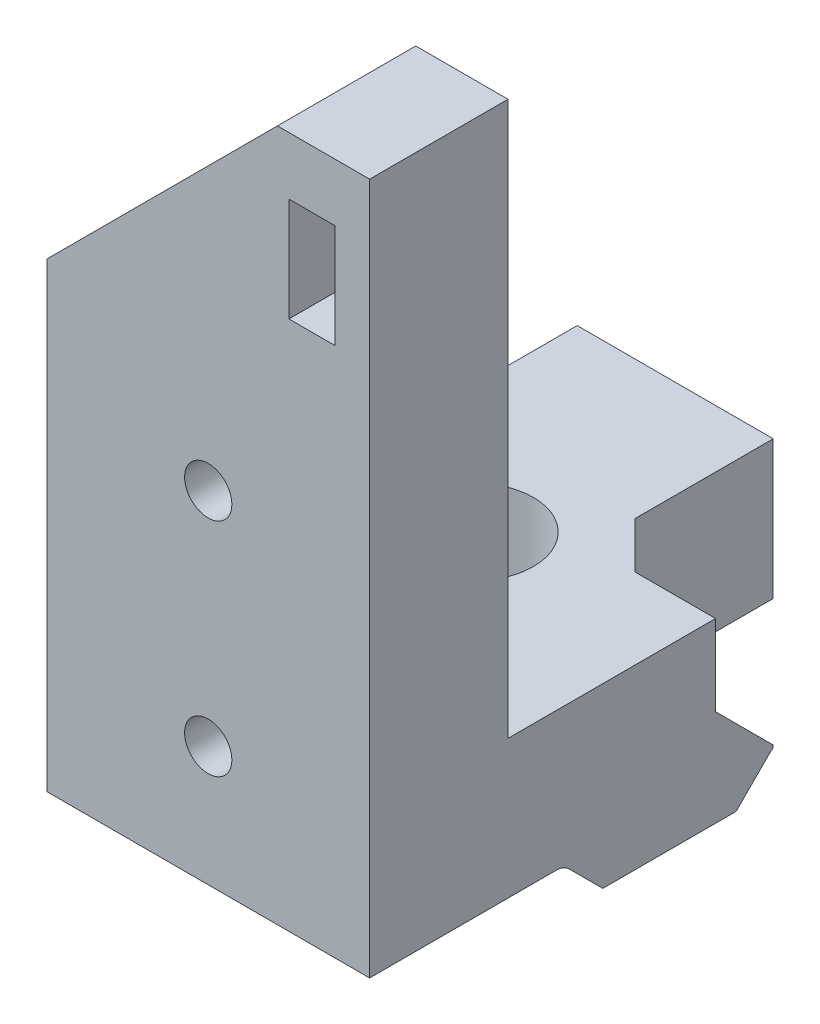
ISO-10303-21;
HEADER;
FILE_DESCRIPTION(('STEP AP214'),'2;1');
FILE_NAME('part.step','',(''),(''),'','','');
FILE_SCHEMA(('AUTOMOTIVE_DESIGN { 1 0 10303 214 1 1 1 1 }'));
ENDSEC;
DATA;
#1=APPLICATION_CONTEXT('core data for automotive mechanical design processes');
#2=APPLICATION_PROTOCOL_DEFINITION('international standard','automotive_design',2000,#1);
#3=PRODUCT_CONTEXT('',#1,'mechanical');
#4=PRODUCT('Part','Part','',(#3));
#5=PRODUCT_RELATED_PRODUCT_CATEGORY('part','',(#4));
#6=PRODUCT_DEFINITION_FORMATION('','',#4);
#7=PRODUCT_DEFINITION_CONTEXT('part definition',#1,'design');
#8=PRODUCT_DEFINITION('design','',#6,#7);
#9=PRODUCT_DEFINITION_SHAPE('','',#8);
#10=(LENGTH_UNIT() NAMED_UNIT(*) SI_UNIT(.MILLI.,.METRE.));
#11=(NAMED_UNIT(*) PLANE_ANGLE_UNIT() SI_UNIT($,.RADIAN.));
#12=(NAMED_UNIT(*) SI_UNIT($,.STERADIAN.) SOLID_ANGLE_UNIT());
#13=UNCERTAINTY_MEASURE_WITH_UNIT(LENGTH_MEASURE(1.E-05),#10,'distance_accuracy_value','');
#14=(GEOMETRIC_REPRESENTATION_CONTEXT(3) GLOBAL_UNCERTAINTY_ASSIGNED_CONTEXT((#13)) GLOBAL_UNIT_ASSIGNED_CONTEXT((#10,
#11,#12)) REPRESENTATION_CONTEXT('',''));
#15=CARTESIAN_POINT('',(0.,0.,0.));
#16=DIRECTION('',(0.,0.,1.));
#17=DIRECTION('',(1.,0.,0.));
#18=AXIS2_PLACEMENT_3D('',#15,#16,#17);
#19=CARTESIAN_POINT('',(46.3642843340703,35.7650594637958,0.));
#20=DIRECTION('',(0.,1.,0.));
#21=DIRECTION('',(0.,0.,1.));
#22=AXIS2_PLACEMENT_3D('',#19,#20,#21);
#23=PLANE('',#22);
#24=DIRECTION('',(-1.,0.,0.));
#25=VECTOR('',#24,1.);
#26=CARTESIAN_POINT('',(46.3642843340703,35.7650594637958,12.7830951969996));
#27=LINE('',#26,#25);
#28=CARTESIAN_POINT('',(46.3642843340703,35.7650594637958,12.7830951969996));
#29=VERTEX_POINT('',#28);
#30=CARTESIAN_POINT('',(32.3642843340703,35.7650594637958,12.7830951969996));
#31=VERTEX_POINT('',#30);
#32=EDGE_CURVE('E343',#29,#31,#27,.T.);
#33=ORIENTED_EDGE('',*,*,#32,.F.);
#34=DIRECTION('',(0.,0.,-1.));
#35=VECTOR('',#34,1.);
#36=CARTESIAN_POINT('',(46.3642843340703,35.7650594637958,0.));
#37=LINE('',#36,#35);
#38=CARTESIAN_POINT('',(46.3642843340703,35.7650594637958,20.8758664827248));
#39=VERTEX_POINT('',#38);
#40=EDGE_CURVE('E290',#39,#29,#37,.T.);
#41=ORIENTED_EDGE('',*,*,#40,.F.);
#42=DIRECTION('',(1.,0.,0.));
#43=VECTOR('',#42,1.);
#44=CARTESIAN_POINT('',(32.3642843340703,35.7650594637958,20.8758664827248));
#45=LINE('',#44,#43);
#46=CARTESIAN_POINT('',(32.3642843340703,35.7650594637958,20.8758664827248));
#47=VERTEX_POINT('',#46);
#48=EDGE_CURVE('E270',#47,#39,#45,.T.);
#49=ORIENTED_EDGE('',*,*,#48,.F.);
#50=DIRECTION('',(0.,0.,-1.));
#51=VECTOR('',#50,1.);
#52=CARTESIAN_POINT('',(32.3642843340703,35.7650594637958,0.));
#53=LINE('',#52,#51);
#54=EDGE_CURVE('E287',#47,#31,#53,.T.);
#55=ORIENTED_EDGE('',*,*,#54,.T.);
#56=EDGE_LOOP('',(#33,#41,#49,#55));
#57=FACE_BOUND('',#56,.T.);
#58=ADVANCED_FACE('F34',(#57),#23,.F.);
#59=CARTESIAN_POINT('',(46.3642843340703,34.9750594637958,12.7830951969996));
#60=DIRECTION('',(-1.,0.,0.));
#61=DIRECTION('',(0.,0.,1.));
#62=AXIS2_PLACEMENT_3D('',#59,#60,#61);
#63=CYLINDRICAL_SURFACE('',#62,0.789999999999999);
#64=CARTESIAN_POINT('',(32.3642843340703,34.9750594637958,12.7830951969996));
#65=DIRECTION('',(1.,0.,0.));
#66=DIRECTION('',(0.,0.,-1.));
#67=AXIS2_PLACEMENT_3D('',#64,#65,#66);
#68=CIRCLE('',#67,0.789999999999999);
#69=CARTESIAN_POINT('',(32.3642843340703,35.5336738209331,12.2244808398622));
#70=VERTEX_POINT('',#69);
#71=EDGE_CURVE('E309',#70,#31,#68,.T.);
#72=ORIENTED_EDGE('',*,*,#71,.F.);
#73=DIRECTION('',(-1.,0.,0.));
#74=VECTOR('',#73,1.);
#75=CARTESIAN_POINT('',(46.3642843340703,35.5336738209331,12.2244808398622));
#76=LINE('',#75,#74);
#77=CARTESIAN_POINT('',(46.3642843340703,35.5336738209331,12.2244808398622));
#78=VERTEX_POINT('',#77);
#79=EDGE_CURVE('E341',#78,#70,#76,.T.);
#80=ORIENTED_EDGE('',*,*,#79,.F.);
#81=CARTESIAN_POINT('',(46.3642843340703,34.9750594637958,12.7830951969996));
#82=DIRECTION('',(1.,0.,0.));
#83=DIRECTION('',(0.,0.,-1.));
#84=AXIS2_PLACEMENT_3D('',#81,#82,#83);
#85=CIRCLE('',#84,0.789999999999999);
#86=EDGE_CURVE('E292',#78,#29,#85,.T.);
#87=ORIENTED_EDGE('',*,*,#86,.T.);
#88=ORIENTED_EDGE('',*,*,#32,.T.);
#89=EDGE_LOOP('',(#72,#80,#87,#88));
#90=FACE_BOUND('',#89,.T.);
#91=ADVANCED_FACE('F446',(#90),#63,.F.);
#92=CARTESIAN_POINT('',(46.3642843340703,11.6545964905354,-11.6545964905355));
#93=DIRECTION('',(0.,-0.707106781186547,0.707106781186548));
#94=DIRECTION('',(0.,-0.707106781186548,-0.707106781186547));
#95=AXIS2_PLACEMENT_3D('',#92,#93,#94);
#96=PLANE('',#95);
#97=DIRECTION('',(0.,0.707106781186548,0.707106781186547));
#98=VECTOR('',#97,1.);
#99=CARTESIAN_POINT('',(32.3642843340703,11.6545964905354,-11.6545964905355));
#100=LINE('',#99,#98);
#101=CARTESIAN_POINT('',(32.3642843340703,34.0750594637958,10.7658664827248));
#102=VERTEX_POINT('',#101);
#103=EDGE_CURVE('E313',#102,#70,#100,.T.);
#104=ORIENTED_EDGE('',*,*,#103,.F.);
#105=DIRECTION('',(-1.,0.,0.));
#106=VECTOR('',#105,1.);
#107=CARTESIAN_POINT('',(46.3642843340703,34.0750594637958,10.7658664827248));
#108=LINE('',#107,#106);
#109=CARTESIAN_POINT('',(46.3642843340703,34.0750594637958,10.7658664827248));
#110=VERTEX_POINT('',#109);
#111=EDGE_CURVE('E339',#110,#102,#108,.T.);
#112=ORIENTED_EDGE('',*,*,#111,.F.);
#113=DIRECTION('',(0.,0.707106781186548,0.707106781186547));
#114=VECTOR('',#113,1.);
#115=CARTESIAN_POINT('',(46.3642843340703,11.6545964905354,-11.6545964905355));
#116=LINE('',#115,#114);
#117=EDGE_CURVE('E296',#110,#78,#116,.T.);
#118=ORIENTED_EDGE('',*,*,#117,.T.);
#119=ORIENTED_EDGE('',*,*,#79,.T.);
#120=EDGE_LOOP('',(#104,#112,#118,#119));
#121=FACE_BOUND('',#120,.T.);
#122=ADVANCED_FACE('F453',(#121),#96,.T.);
#123=CARTESIAN_POINT('',(46.3642843340703,34.0750594637958,0.));
#124=DIRECTION('',(0.,1.,0.));
#125=DIRECTION('',(0.,0.,1.));
#126=AXIS2_PLACEMENT_3D('',#123,#124,#125);
#127=PLANE('',#126);
#128=CARTESIAN_POINT('',(37.8642843340703,34.0750594637958,7.87586648272481));
#129=DIRECTION('',(0.,-1.,0.));
#130=DIRECTION('',(0.,0.,-1.));
#131=AXIS2_PLACEMENT_3D('',#128,#129,#130);
#132=CIRCLE('',#131,2.6);
#133=CARTESIAN_POINT('',(37.8642843340703,34.0750594637958,5.27586648272481));
#134=VERTEX_POINT('',#133);
#135=EDGE_CURVE('E284',#134,#134,#132,.T.);
#136=ORIENTED_EDGE('',*,*,#135,.F.);
#137=EDGE_LOOP('',(#136));
#138=FACE_BOUND('',#137,.T.);
#139=DIRECTION('',(0.,0.,-1.));
#140=VECTOR('',#139,1.);
#141=CARTESIAN_POINT('',(32.3642843340703,34.0750594637958,0.));
#142=LINE('',#141,#140);
#143=CARTESIAN_POINT('',(32.3642843340703,34.0750594637958,4.98586648272482));
#144=VERTEX_POINT('',#143);
#145=EDGE_CURVE('E316',#102,#144,#142,.T.);
#146=ORIENTED_EDGE('',*,*,#145,.T.);
#147=DIRECTION('',(-1.,0.,0.));
#148=VECTOR('',#147,1.);
#149=CARTESIAN_POINT('',(46.3642843340703,34.0750594637958,4.98586648272482));
#150=LINE('',#149,#148);
#151=CARTESIAN_POINT('',(46.3642843340703,34.0750594637958,4.98586648272482));
#152=VERTEX_POINT('',#151);
#153=EDGE_CURVE('E337',#152,#144,#150,.T.);
#154=ORIENTED_EDGE('',*,*,#153,.F.);
#155=DIRECTION('',(0.,0.,-1.));
#156=VECTOR('',#155,1.);
#157=CARTESIAN_POINT('',(46.3642843340703,34.0750594637958,0.));
#158=LINE('',#157,#156);
#159=EDGE_CURVE('E299',#110,#152,#158,.T.);
#160=ORIENTED_EDGE('',*,*,#159,.F.);
#161=ORIENTED_EDGE('',*,*,#111,.T.);
#162=EDGE_LOOP('',(#146,#154,#160,#161));
#163=FACE_BOUND('',#162,.T.);
#164=ADVANCED_FACE('F497',(#138,#163),#127,.F.);
#165=CARTESIAN_POINT('',(46.3642843340703,19.5304629732602,19.5304629732603));
#166=DIRECTION('',(0.,-0.707106781186547,-0.707106781186549));
#167=DIRECTION('',(0.,0.707106781186549,-0.707106781186546));
#168=AXIS2_PLACEMENT_3D('',#165,#166,#167);
#169=PLANE('',#168);
#170=DIRECTION('',(0.,-0.707106781186549,0.707106781186546));
#171=VECTOR('',#170,1.);
#172=CARTESIAN_POINT('',(32.3642843340703,19.5304629732602,19.5304629732603));
#173=LINE('',#172,#171);
#174=CARTESIAN_POINT('',(32.3642843340703,35.5336738209331,3.52725212558745));
#175=VERTEX_POINT('',#174);
#176=EDGE_CURVE('E319',#175,#144,#173,.T.);
#177=ORIENTED_EDGE('',*,*,#176,.F.);
#178=DIRECTION('',(-1.,0.,0.));
#179=VECTOR('',#178,1.);
#180=CARTESIAN_POINT('',(46.3642843340703,35.5336738209331,3.52725212558745));
#181=LINE('',#180,#179);
#182=CARTESIAN_POINT('',(46.3642843340703,35.5336738209331,3.52725212558745));
#183=VERTEX_POINT('',#182);
#184=EDGE_CURVE('E335',#183,#175,#181,.T.);
#185=ORIENTED_EDGE('',*,*,#184,.F.);
#186=DIRECTION('',(0.,-0.707106781186549,0.707106781186546));
#187=VECTOR('',#186,1.);
#188=CARTESIAN_POINT('',(46.3642843340703,19.5304629732602,19.5304629732603));
#189=LINE('',#188,#187);
#190=EDGE_CURVE('E301',#183,#152,#189,.T.);
#191=ORIENTED_EDGE('',*,*,#190,.T.);
#192=ORIENTED_EDGE('',*,*,#153,.T.);
#193=EDGE_LOOP('',(#177,#185,#191,#192));
#194=FACE_BOUND('',#193,.T.);
#195=ADVANCED_FACE('F468',(#194),#169,.T.);
#196=CARTESIAN_POINT('',(46.3642843340703,34.9750594637958,2.96863776845007));
#197=DIRECTION('',(-1.,0.,0.));
#198=DIRECTION('',(0.,0.,1.));
#199=AXIS2_PLACEMENT_3D('',#196,#197,#198);
#200=CYLINDRICAL_SURFACE('',#199,0.790000000000005);
#201=DIRECTION('',(-1.,0.,0.));
#202=VECTOR('',#201,1.);
#203=CARTESIAN_POINT('',(46.3642843340703,35.6520120280646,3.37586648272482));
#204=LINE('',#203,#202);
#205=CARTESIAN_POINT('',(46.3642843340703,35.6520120280646,3.37586648272482));
#206=VERTEX_POINT('',#205);
#207=CARTESIAN_POINT('',(40.8642843340703,35.6520120280646,3.37586648272482));
#208=VERTEX_POINT('',#207);
#209=EDGE_CURVE('E237',#206,#208,#204,.T.);
#210=ORIENTED_EDGE('',*,*,#209,.F.);
#211=CARTESIAN_POINT('',(46.3642843340703,34.9750594637958,2.96863776845007));
#212=DIRECTION('',(1.,0.,0.));
#213=DIRECTION('',(0.,0.,-1.));
#214=AXIS2_PLACEMENT_3D('',#211,#212,#213);
#215=CIRCLE('',#214,0.790000000000005);
#216=EDGE_CURVE('E304',#206,#183,#215,.T.);
#217=ORIENTED_EDGE('',*,*,#216,.T.);
#218=ORIENTED_EDGE('',*,*,#184,.T.);
#219=CARTESIAN_POINT('',(32.3642843340703,34.9750594637958,2.96863776845007));
#220=DIRECTION('',(1.,0.,0.));
#221=DIRECTION('',(0.,0.,-1.));
#222=AXIS2_PLACEMENT_3D('',#219,#220,#221);
#223=CIRCLE('',#222,0.790000000000005);
#224=CARTESIAN_POINT('',(32.3642843340703,35.7650594637958,2.96863776845007));
#225=VERTEX_POINT('',#224);
#226=EDGE_CURVE('E322',#225,#175,#223,.T.);
#227=ORIENTED_EDGE('',*,*,#226,.F.);
#228=DIRECTION('',(-1.,0.,0.));
#229=VECTOR('',#228,1.);
#230=CARTESIAN_POINT('',(46.3642843340703,35.7650594637958,2.96863776845007));
#231=LINE('',#230,#229);
#232=CARTESIAN_POINT('',(40.8642843340703,35.7650594637958,2.96863776845007));
#233=VERTEX_POINT('',#232);
#234=EDGE_CURVE('E333',#233,#225,#231,.T.);
#235=ORIENTED_EDGE('',*,*,#234,.F.);
#236=CARTESIAN_POINT('',(40.8642843340703,34.9750594637958,2.96863776845007));
#237=DIRECTION('',(-1.,0.,0.));
#238=DIRECTION('',(0.,0.,1.));
#239=AXIS2_PLACEMENT_3D('',#236,#237,#238);
#240=CIRCLE('',#239,0.790000000000005);
#241=EDGE_CURVE('E241',#208,#233,#240,.T.);
#242=ORIENTED_EDGE('',*,*,#241,.F.);
#243=EDGE_LOOP('',(#210,#217,#218,#227,#235,#242));
#244=FACE_BOUND('',#243,.T.);
#245=ADVANCED_FACE('F461',(#244),#200,.F.);
#246=DIRECTION('',(-1.,0.,0.));
#247=VECTOR('',#246,1.);
#248=CARTESIAN_POINT('',(46.3642843340703,35.7650594637958,-2.12413351727518));
#249=LINE('',#248,#247);
#250=CARTESIAN_POINT('',(40.8642843340703,35.7650594637958,-2.12413351727518));
#251=VERTEX_POINT('',#250);
#252=CARTESIAN_POINT('',(32.3642843340703,35.7650594637958,-2.12413351727518));
#253=VERTEX_POINT('',#252);
#254=EDGE_CURVE('E331',#251,#253,#249,.T.);
#255=ORIENTED_EDGE('',*,*,#254,.F.);
#256=DIRECTION('',(0.,0.,-1.));
#257=VECTOR('',#256,1.);
#258=CARTESIAN_POINT('',(40.8642843340703,35.7650594637958,5.87586648272482));
#259=LINE('',#258,#257);
#260=EDGE_CURVE('E244',#233,#251,#259,.T.);
#261=ORIENTED_EDGE('',*,*,#260,.F.);
#262=ORIENTED_EDGE('',*,*,#234,.T.);
#263=EDGE_CURVE('E310',#225,#253,#53,.T.);
#264=ORIENTED_EDGE('',*,*,#263,.T.);
#265=EDGE_LOOP('',(#255,#261,#262,#264));
#266=FACE_BOUND('',#265,.T.);
#267=ADVANCED_FACE('F449',(#266),#23,.F.);
#268=CARTESIAN_POINT('',(46.3642843340703,0.,-2.12413351727518));
#269=DIRECTION('',(0.,0.,1.));
#270=DIRECTION('',(1.,0.,0.));
#271=AXIS2_PLACEMENT_3D('',#268,#269,#270);
#272=PLANE('',#271);
#273=DIRECTION('',(-1.,0.,0.));
#274=VECTOR('',#273,1.);
#275=CARTESIAN_POINT('',(46.3642843340703,41.7650594637958,-2.12413351727518));
#276=LINE('',#275,#274);
#277=CARTESIAN_POINT('',(40.8642843340703,41.7650594637958,-2.12413351727518));
#278=VERTEX_POINT('',#277);
#279=CARTESIAN_POINT('',(32.3642843340703,41.7650594637958,-2.12413351727518));
#280=VERTEX_POINT('',#279);
#281=EDGE_CURVE('E307',#278,#280,#276,.T.);
#282=ORIENTED_EDGE('',*,*,#281,.F.);
#283=DIRECTION('',(0.,1.,0.));
#284=VECTOR('',#283,1.);
#285=CARTESIAN_POINT('',(40.8642843340703,26.056815544322,-2.12413351727518));
#286=LINE('',#285,#284);
#287=EDGE_CURVE('E247',#251,#278,#286,.T.);
#288=ORIENTED_EDGE('',*,*,#287,.F.);
#289=ORIENTED_EDGE('',*,*,#254,.T.);
#290=DIRECTION('',(0.,1.,0.));
#291=VECTOR('',#290,1.);
#292=CARTESIAN_POINT('',(32.3642843340703,0.,-2.12413351727518));
#293=LINE('',#292,#291);
#294=EDGE_CURVE('E325',#253,#280,#293,.T.);
#295=ORIENTED_EDGE('',*,*,#294,.T.);
#296=EDGE_LOOP('',(#282,#288,#289,#295));
#297=FACE_BOUND('',#296,.T.);
#298=ADVANCED_FACE('F460',(#297),#272,.F.);
#299=CARTESIAN_POINT('',(46.3642843340703,41.7650594637958,0.));
#300=DIRECTION('',(0.,1.,0.));
#301=DIRECTION('',(0.,0.,1.));
#302=AXIS2_PLACEMENT_3D('',#299,#300,#301);
#303=PLANE('',#302);
#304=DIRECTION('',(0.,0.,1.));
#305=VECTOR('',#304,1.);
#306=CARTESIAN_POINT('',(40.8642843340703,41.7650594637958,5.87586648272482));
#307=LINE('',#306,#305);
#308=CARTESIAN_POINT('',(40.8642843340703,41.7650594637958,3.87586648272482));
#309=VERTEX_POINT('',#308);
#310=EDGE_CURVE('E243',#278,#309,#307,.T.);
#311=ORIENTED_EDGE('',*,*,#310,.F.);
#312=ORIENTED_EDGE('',*,*,#281,.T.);
#313=DIRECTION('',(0.,0.,-1.));
#314=VECTOR('',#313,1.);
#315=CARTESIAN_POINT('',(32.3642843340703,41.7650594637958,0.));
#316=LINE('',#315,#314);
#317=CARTESIAN_POINT('',(32.3642843340703,41.7650594637958,14.8758664827248));
#318=VERTEX_POINT('',#317);
#319=EDGE_CURVE('E293',#318,#280,#316,.T.);
#320=ORIENTED_EDGE('',*,*,#319,.F.);
#321=DIRECTION('',(-1.,0.,0.));
#322=VECTOR('',#321,1.);
#323=CARTESIAN_POINT('',(46.3642843340703,41.7650594637958,14.8758664827248));
#324=LINE('',#323,#322);
#325=CARTESIAN_POINT('',(38.7234840531715,41.7650594637958,14.8758664827248));
#326=VERTEX_POINT('',#325);
#327=EDGE_CURVE('E279',#326,#318,#324,.T.);
#328=ORIENTED_EDGE('',*,*,#327,.F.);
#329=CARTESIAN_POINT('',(40.0050846149692,41.7650594637958,14.8758664827248));
#330=VERTEX_POINT('',#329);
#331=EDGE_CURVE('E283',#330,#326,#324,.T.);
#332=ORIENTED_EDGE('',*,*,#331,.F.);
#333=CARTESIAN_POINT('',(46.3642843340703,41.7650594637958,14.8758664827248));
#334=VERTEX_POINT('',#333);
#335=EDGE_CURVE('E280',#334,#330,#324,.T.);
#336=ORIENTED_EDGE('',*,*,#335,.F.);
#337=DIRECTION('',(0.,0.,-1.));
#338=VECTOR('',#337,1.);
#339=CARTESIAN_POINT('',(46.3642843340703,41.7650594637958,0.));
#340=LINE('',#339,#338);
#341=CARTESIAN_POINT('',(46.3642843340703,41.7650594637958,5.87586648272482));
#342=VERTEX_POINT('',#341);
#343=EDGE_CURVE('E198',#334,#342,#340,.T.);
#344=ORIENTED_EDGE('',*,*,#343,.T.);
#345=DIRECTION('',(1.,0.,0.));
#346=VECTOR('',#345,1.);
#347=CARTESIAN_POINT('',(40.8642843340703,41.7650594637958,5.87586648272482));
#348=LINE('',#347,#346);
#349=CARTESIAN_POINT('',(42.8642843340704,41.7650594637958,5.87586648272482));
#350=VERTEX_POINT('',#349);
#351=EDGE_CURVE('E250',#350,#342,#348,.T.);
#352=ORIENTED_EDGE('',*,*,#351,.F.);
#353=DIRECTION('',(0.707106781186552,0.,0.707106781186543));
#354=VECTOR('',#353,1.);
#355=CARTESIAN_POINT('',(42.8642843340704,41.7650594637958,5.87586648272482));
#356=LINE('',#355,#354);
#357=EDGE_CURVE('E350',#350,#309,#356,.F.);
#358=ORIENTED_EDGE('',*,*,#357,.T.);
#359=EDGE_LOOP('',(#311,#312,#320,#328,#332,#336,#344,#352,#358));
#360=FACE_BOUND('',#359,.T.);
#361=CARTESIAN_POINT('',(37.8642843340703,41.7650594637958,7.87586648272481));
#362=DIRECTION('',(0.,1.,0.));
#363=DIRECTION('',(0.,0.,1.));
#364=AXIS2_PLACEMENT_3D('',#361,#362,#363);
#365=CIRCLE('',#364,2.6);
#366=CARTESIAN_POINT('',(37.8642843340703,41.7650594637958,10.4758664827248));
#367=VERTEX_POINT('',#366);
#368=EDGE_CURVE('E282',#367,#367,#365,.F.);
#369=ORIENTED_EDGE('',*,*,#368,.T.);
#370=EDGE_LOOP('',(#369));
#371=FACE_BOUND('',#370,.T.);
#372=ADVANCED_FACE('F374',(#360,#371),#303,.T.);
#373=CARTESIAN_POINT('',(46.3642843340703,0.,0.));
#374=DIRECTION('',(1.,0.,0.));
#375=DIRECTION('',(0.,0.,-1.));
#376=AXIS2_PLACEMENT_3D('',#373,#374,#375);
#377=PLANE('',#376);
#378=DIRECTION('',(0.,1.,0.));
#379=VECTOR('',#378,1.);
#380=CARTESIAN_POINT('',(46.3642843340703,34.0750594637958,3.37586648272482));
#381=LINE('',#380,#379);
#382=CARTESIAN_POINT('',(46.3642843340703,35.7650594637958,3.37586648272482));
#383=VERTEX_POINT('',#382);
#384=EDGE_CURVE('E235',#206,#383,#381,.T.);
#385=ORIENTED_EDGE('',*,*,#384,.T.);
#386=DIRECTION('',(0.,0.707106781186551,0.707106781186544));
#387=VECTOR('',#386,1.);
#388=CARTESIAN_POINT('',(46.3642843340703,38.2650594637958,5.87586648272482));
#389=LINE('',#388,#387);
#390=CARTESIAN_POINT('',(46.3642843340703,38.2650594637958,5.87586648272482));
#391=VERTEX_POINT('',#390);
#392=EDGE_CURVE('E11',#383,#391,#389,.T.);
#393=ORIENTED_EDGE('',*,*,#392,.T.);
#394=DIRECTION('',(0.,1.,0.));
#395=VECTOR('',#394,1.);
#396=CARTESIAN_POINT('',(46.3642843340703,26.056815544322,5.87586648272482));
#397=LINE('',#396,#395);
#398=EDGE_CURVE('E253',#391,#342,#397,.T.);
#399=ORIENTED_EDGE('',*,*,#398,.T.);
#400=ORIENTED_EDGE('',*,*,#343,.F.);
#401=DIRECTION('',(0.,1.,0.));
#402=VECTOR('',#401,1.);
#403=CARTESIAN_POINT('',(46.3642843340703,35.7650594637958,14.8758664827248));
#404=LINE('',#403,#402);
#405=CARTESIAN_POINT('',(46.3642843340703,65.7650594637958,14.8758664827248));
#406=VERTEX_POINT('',#405);
#407=EDGE_CURVE('E189',#334,#406,#404,.T.);
#408=ORIENTED_EDGE('',*,*,#407,.T.);
#409=DIRECTION('',(0.,0.,1.));
#410=VECTOR('',#409,1.);
#411=CARTESIAN_POINT('',(46.3642843340703,65.7650594637958,-2.32878405136044));
#412=LINE('',#411,#410);
#413=CARTESIAN_POINT('',(46.3642843340703,65.7650594637958,20.8758664827248));
#414=VERTEX_POINT('',#413);
#415=EDGE_CURVE('E195',#406,#414,#412,.T.);
#416=ORIENTED_EDGE('',*,*,#415,.T.);
#417=DIRECTION('',(0.,1.,0.));
#418=VECTOR('',#417,1.);
#419=CARTESIAN_POINT('',(46.3642843340703,35.7650594637958,20.8758664827248));
#420=LINE('',#419,#418);
#421=EDGE_CURVE('E273',#39,#414,#420,.T.);
#422=ORIENTED_EDGE('',*,*,#421,.F.);
#423=ORIENTED_EDGE('',*,*,#40,.T.);
#424=ORIENTED_EDGE('',*,*,#86,.F.);
#425=ORIENTED_EDGE('',*,*,#117,.F.);
#426=ORIENTED_EDGE('',*,*,#159,.T.);
#427=ORIENTED_EDGE('',*,*,#190,.F.);
#428=ORIENTED_EDGE('',*,*,#216,.F.);
#429=EDGE_LOOP('',(#385,#393,#399,#400,#408,#416,#422,#423,#424,#425,#426,#427,#428));
#430=FACE_BOUND('',#429,.T.);
#431=ADVANCED_FACE('F192',(#430),#377,.T.);
#432=CARTESIAN_POINT('',(32.3642843340703,0.,0.));
#433=DIRECTION('',(1.,0.,0.));
#434=DIRECTION('',(0.,0.,-1.));
#435=AXIS2_PLACEMENT_3D('',#432,#433,#434);
#436=PLANE('',#435);
#437=DIRECTION('',(0.,-1.,0.));
#438=VECTOR('',#437,1.);
#439=CARTESIAN_POINT('',(32.3642843340703,35.7650594637958,14.8758664827248));
#440=LINE('',#439,#438);
#441=CARTESIAN_POINT('',(32.3642843340703,55.7650594637958,14.8758664827248));
#442=VERTEX_POINT('',#441);
#443=EDGE_CURVE('E203',#442,#318,#440,.T.);
#444=ORIENTED_EDGE('',*,*,#443,.T.);
#445=ORIENTED_EDGE('',*,*,#319,.T.);
#446=ORIENTED_EDGE('',*,*,#294,.F.);
#447=ORIENTED_EDGE('',*,*,#263,.F.);
#448=ORIENTED_EDGE('',*,*,#226,.T.);
#449=ORIENTED_EDGE('',*,*,#176,.T.);
#450=ORIENTED_EDGE('',*,*,#145,.F.);
#451=ORIENTED_EDGE('',*,*,#103,.T.);
#452=ORIENTED_EDGE('',*,*,#71,.T.);
#453=ORIENTED_EDGE('',*,*,#54,.F.);
#454=DIRECTION('',(0.,-1.,0.));
#455=VECTOR('',#454,1.);
#456=CARTESIAN_POINT('',(32.3642843340703,35.7650594637958,20.8758664827248));
#457=LINE('',#456,#455);
#458=CARTESIAN_POINT('',(32.3642843340703,55.7650594637958,20.8758664827248));
#459=VERTEX_POINT('',#458);
#460=EDGE_CURVE('E265',#459,#47,#457,.T.);
#461=ORIENTED_EDGE('',*,*,#460,.F.);
#462=DIRECTION('',(0.,0.,1.));
#463=VECTOR('',#462,1.);
#464=CARTESIAN_POINT('',(32.3642843340703,55.7650594637958,14.8758664827248));
#465=LINE('',#464,#463);
#466=EDGE_CURVE('E202',#442,#459,#465,.T.);
#467=ORIENTED_EDGE('',*,*,#466,.F.);
#468=EDGE_LOOP('',(#444,#445,#446,#447,#448,#449,#450,#451,#452,#453,#461,#467));
#469=FACE_BOUND('',#468,.T.);
#470=ADVANCED_FACE('F481',(#469),#436,.F.);
#471=CARTESIAN_POINT('',(37.8642843340703,41.7660594637958,7.87586648272481));
#472=DIRECTION('',(0.,-1.,0.));
#473=DIRECTION('',(0.,0.,-1.));
#474=AXIS2_PLACEMENT_3D('',#471,#472,#473);
#475=CYLINDRICAL_SURFACE('',#474,2.6);
#476=ORIENTED_EDGE('',*,*,#368,.F.);
#477=EDGE_LOOP('',(#476));
#478=FACE_BOUND('',#477,.T.);
#479=ORIENTED_EDGE('',*,*,#135,.T.);
#480=EDGE_LOOP('',(#479));
#481=FACE_BOUND('',#480,.T.);
#482=ADVANCED_FACE('F531',(#478,#481),#475,.F.);
#483=CARTESIAN_POINT('',(0.,0.,14.8758664827248));
#484=DIRECTION('',(0.,0.,-1.));
#485=DIRECTION('',(-1.,0.,0.));
#486=AXIS2_PLACEMENT_3D('',#483,#484,#485);
#487=PLANE('',#486);
#488=CARTESIAN_POINT('',(39.3642843340703,40.9650594637958,14.8758664827248));
#489=DIRECTION('',(0.,0.,1.));
#490=DIRECTION('',(1.,0.,0.));
#491=AXIS2_PLACEMENT_3D('',#488,#489,#490);
#492=CIRCLE('',#491,1.025);
#493=EDGE_CURVE('E256',#330,#326,#492,.T.);
#494=ORIENTED_EDGE('',*,*,#493,.T.);
#495=ORIENTED_EDGE('',*,*,#327,.T.);
#496=ORIENTED_EDGE('',*,*,#443,.F.);
#497=DIRECTION('',(-0.707106781186551,-0.707106781186544,0.));
#498=VECTOR('',#497,1.);
#499=CARTESIAN_POINT('',(42.3642843340704,65.7650594637958,14.8758664827248));
#500=LINE('',#499,#498);
#501=CARTESIAN_POINT('',(42.3642843340704,65.7650594637958,14.8758664827248));
#502=VERTEX_POINT('',#501);
#503=EDGE_CURVE('E211',#502,#442,#500,.T.);
#504=ORIENTED_EDGE('',*,*,#503,.F.);
#505=DIRECTION('',(-1.,0.,0.));
#506=VECTOR('',#505,1.);
#507=CARTESIAN_POINT('',(46.3642843340703,65.7650594637958,14.8758664827248));
#508=LINE('',#507,#506);
#509=EDGE_CURVE('E206',#406,#502,#508,.T.);
#510=ORIENTED_EDGE('',*,*,#509,.F.);
#511=ORIENTED_EDGE('',*,*,#407,.F.);
#512=ORIENTED_EDGE('',*,*,#335,.T.);
#513=EDGE_LOOP('',(#494,#495,#496,#504,#510,#511,#512));
#514=FACE_BOUND('',#513,.T.);
#515=CARTESIAN_POINT('',(39.3642843340703,50.5650594637958,14.8758664827248));
#516=DIRECTION('',(0.,0.,1.));
#517=DIRECTION('',(1.,0.,0.));
#518=AXIS2_PLACEMENT_3D('',#515,#516,#517);
#519=CIRCLE('',#518,1.025);
#520=CARTESIAN_POINT('',(40.3892843340703,50.5650594637958,14.8758664827248));
#521=VERTEX_POINT('',#520);
#522=EDGE_CURVE('E262',#521,#521,#519,.T.);
#523=ORIENTED_EDGE('',*,*,#522,.T.);
#524=EDGE_LOOP('',(#523));
#525=FACE_BOUND('',#524,.T.);
#526=DIRECTION('',(-1.,0.,0.));
#527=VECTOR('',#526,1.);
#528=CARTESIAN_POINT('',(42.8642843340703,63.2650594637958,14.8758664827248));
#529=LINE('',#528,#527);
#530=CARTESIAN_POINT('',(44.8642843340703,63.2650594637958,14.8758664827248));
#531=VERTEX_POINT('',#530);
#532=CARTESIAN_POINT('',(42.8642843340703,63.2650594637958,14.8758664827248));
#533=VERTEX_POINT('',#532);
#534=EDGE_CURVE('E415',#531,#533,#529,.T.);
#535=ORIENTED_EDGE('',*,*,#534,.T.);
#536=DIRECTION('',(0.,-1.,0.));
#537=VECTOR('',#536,1.);
#538=CARTESIAN_POINT('',(42.8642843340703,63.2650594637958,14.8758664827248));
#539=LINE('',#538,#537);
#540=CARTESIAN_POINT('',(42.8642843340703,58.7650594637958,14.8758664827248));
#541=VERTEX_POINT('',#540);
#542=EDGE_CURVE('E411',#533,#541,#539,.T.);
#543=ORIENTED_EDGE('',*,*,#542,.T.);
#544=DIRECTION('',(1.,0.,0.));
#545=VECTOR('',#544,1.);
#546=CARTESIAN_POINT('',(42.8642843340703,58.7650594637958,14.8758664827248));
#547=LINE('',#546,#545);
#548=CARTESIAN_POINT('',(44.8642843340703,58.7650594637958,14.8758664827248));
#549=VERTEX_POINT('',#548);
#550=EDGE_CURVE('E414',#541,#549,#547,.T.);
#551=ORIENTED_EDGE('',*,*,#550,.T.);
#552=DIRECTION('',(0.,1.,0.));
#553=VECTOR('',#552,1.);
#554=CARTESIAN_POINT('',(44.8642843340703,63.2650594637958,14.8758664827248));
#555=LINE('',#554,#553);
#556=EDGE_CURVE('E239',#549,#531,#555,.T.);
#557=ORIENTED_EDGE('',*,*,#556,.T.);
#558=EDGE_LOOP('',(#535,#543,#551,#557));
#559=FACE_BOUND('',#558,.T.);
#560=ADVANCED_FACE('F208',(#514,#525,#559),#487,.T.);
#561=CARTESIAN_POINT('',(0.,0.,20.8758664827248));
#562=DIRECTION('',(0.,0.,-1.));
#563=DIRECTION('',(-1.,0.,0.));
#564=AXIS2_PLACEMENT_3D('',#561,#562,#563);
#565=PLANE('',#564);
#566=CARTESIAN_POINT('',(39.3642843340703,40.9650594637958,20.8758664827248));
#567=DIRECTION('',(0.,0.,1.));
#568=DIRECTION('',(1.,0.,0.));
#569=AXIS2_PLACEMENT_3D('',#566,#567,#568);
#570=CIRCLE('',#569,1.025);
#571=CARTESIAN_POINT('',(40.3892843340703,40.9650594637958,20.8758664827248));
#572=VERTEX_POINT('',#571);
#573=EDGE_CURVE('E246',#572,#572,#570,.T.);
#574=ORIENTED_EDGE('',*,*,#573,.F.);
#575=EDGE_LOOP('',(#574));
#576=FACE_BOUND('',#575,.T.);
#577=CARTESIAN_POINT('',(39.3642843340703,50.5650594637958,20.8758664827248));
#578=DIRECTION('',(0.,0.,1.));
#579=DIRECTION('',(1.,0.,0.));
#580=AXIS2_PLACEMENT_3D('',#577,#578,#579);
#581=CIRCLE('',#580,1.025);
#582=CARTESIAN_POINT('',(40.3892843340703,50.5650594637958,20.8758664827248));
#583=VERTEX_POINT('',#582);
#584=EDGE_CURVE('E258',#583,#583,#581,.T.);
#585=ORIENTED_EDGE('',*,*,#584,.F.);
#586=EDGE_LOOP('',(#585));
#587=FACE_BOUND('',#586,.T.);
#588=ORIENTED_EDGE('',*,*,#460,.T.);
#589=ORIENTED_EDGE('',*,*,#48,.T.);
#590=ORIENTED_EDGE('',*,*,#421,.T.);
#591=DIRECTION('',(-1.,0.,0.));
#592=VECTOR('',#591,1.);
#593=CARTESIAN_POINT('',(46.3642843340703,65.7650594637958,20.8758664827248));
#594=LINE('',#593,#592);
#595=CARTESIAN_POINT('',(42.3642843340704,65.7650594637958,20.8758664827248));
#596=VERTEX_POINT('',#595);
#597=EDGE_CURVE('E218',#414,#596,#594,.T.);
#598=ORIENTED_EDGE('',*,*,#597,.T.);
#599=DIRECTION('',(-0.707106781186551,-0.707106781186544,0.));
#600=VECTOR('',#599,1.);
#601=CARTESIAN_POINT('',(42.3642843340704,65.7650594637958,20.8758664827248));
#602=LINE('',#601,#600);
#603=EDGE_CURVE('E418',#596,#459,#602,.T.);
#604=ORIENTED_EDGE('',*,*,#603,.T.);
#605=EDGE_LOOP('',(#588,#589,#590,#598,#604));
#606=FACE_BOUND('',#605,.T.);
#607=DIRECTION('',(0.,-1.,0.));
#608=VECTOR('',#607,1.);
#609=CARTESIAN_POINT('',(42.8642843340703,63.2650594637958,20.8758664827248));
#610=LINE('',#609,#608);
#611=CARTESIAN_POINT('',(42.8642843340703,63.2650594637958,20.8758664827248));
#612=VERTEX_POINT('',#611);
#613=CARTESIAN_POINT('',(42.8642843340703,58.7650594637958,20.8758664827248));
#614=VERTEX_POINT('',#613);
#615=EDGE_CURVE('E221',#612,#614,#610,.T.);
#616=ORIENTED_EDGE('',*,*,#615,.F.);
#617=DIRECTION('',(-1.,0.,0.));
#618=VECTOR('',#617,1.);
#619=CARTESIAN_POINT('',(42.8642843340703,63.2650594637958,20.8758664827248));
#620=LINE('',#619,#618);
#621=CARTESIAN_POINT('',(44.8642843340703,63.2650594637958,20.8758664827248));
#622=VERTEX_POINT('',#621);
#623=EDGE_CURVE('E228',#622,#612,#620,.T.);
#624=ORIENTED_EDGE('',*,*,#623,.F.);
#625=DIRECTION('',(0.,1.,0.));
#626=VECTOR('',#625,1.);
#627=CARTESIAN_POINT('',(44.8642843340703,63.2650594637958,20.8758664827248));
#628=LINE('',#627,#626);
#629=CARTESIAN_POINT('',(44.8642843340703,58.7650594637958,20.8758664827248));
#630=VERTEX_POINT('',#629);
#631=EDGE_CURVE('E231',#630,#622,#628,.T.);
#632=ORIENTED_EDGE('',*,*,#631,.F.);
#633=DIRECTION('',(1.,0.,0.));
#634=VECTOR('',#633,1.);
#635=CARTESIAN_POINT('',(42.8642843340703,58.7650594637958,20.8758664827248));
#636=LINE('',#635,#634);
#637=EDGE_CURVE('E234',#614,#630,#636,.T.);
#638=ORIENTED_EDGE('',*,*,#637,.F.);
#639=EDGE_LOOP('',(#616,#624,#632,#638));
#640=FACE_BOUND('',#639,.T.);
#641=ADVANCED_FACE('F391',(#576,#587,#606,#640),#565,.F.);
#642=CARTESIAN_POINT('',(39.3642843340703,50.5650594637958,14.8758664827248));
#643=DIRECTION('',(0.,0.,1.));
#644=DIRECTION('',(1.,0.,0.));
#645=AXIS2_PLACEMENT_3D('',#642,#643,#644);
#646=CYLINDRICAL_SURFACE('',#645,1.025);
#647=ORIENTED_EDGE('',*,*,#522,.F.);
#648=EDGE_LOOP('',(#647));
#649=FACE_BOUND('',#648,.T.);
#650=ORIENTED_EDGE('',*,*,#584,.T.);
#651=EDGE_LOOP('',(#650));
#652=FACE_BOUND('',#651,.T.);
#653=ADVANCED_FACE('F387',(#649,#652),#646,.F.);
#654=CARTESIAN_POINT('',(39.3642843340703,40.9650594637958,14.8758664827248));
#655=DIRECTION('',(0.,0.,1.));
#656=DIRECTION('',(1.,0.,0.));
#657=AXIS2_PLACEMENT_3D('',#654,#655,#656);
#658=CYLINDRICAL_SURFACE('',#657,1.025);
#659=ORIENTED_EDGE('',*,*,#493,.F.);
#660=EDGE_CURVE('E259',#326,#330,#492,.T.);
#661=ORIENTED_EDGE('',*,*,#660,.F.);
#662=EDGE_LOOP('',(#659,#661));
#663=FACE_BOUND('',#662,.T.);
#664=ORIENTED_EDGE('',*,*,#573,.T.);
#665=EDGE_LOOP('',(#664));
#666=FACE_BOUND('',#665,.T.);
#667=ADVANCED_FACE('F384',(#663,#666),#658,.F.);
#668=CARTESIAN_POINT('',(39.3642843340703,40.9650594637958,14.8758664827248));
#669=DIRECTION('',(0.,0.,1.));
#670=DIRECTION('',(1.,0.,0.));
#671=AXIS2_PLACEMENT_3D('',#668,#669,#670);
#672=PLANE('',#671);
#673=ORIENTED_EDGE('',*,*,#660,.T.);
#674=ORIENTED_EDGE('',*,*,#331,.T.);
#675=EDGE_LOOP('',(#673,#674));
#676=FACE_BOUND('',#675,.T.);
#677=ADVANCED_FACE('F383',(#676),#672,.T.);
#678=CARTESIAN_POINT('',(40.8642843340703,26.056815544322,5.87586648272482));
#679=DIRECTION('',(-1.,0.,0.));
#680=DIRECTION('',(0.,0.,1.));
#681=AXIS2_PLACEMENT_3D('',#678,#679,#680);
#682=PLANE('',#681);
#683=DIRECTION('',(0.,-1.,0.));
#684=VECTOR('',#683,1.);
#685=CARTESIAN_POINT('',(40.8642843340703,35.7650594637958,3.87586648272482));
#686=LINE('',#685,#684);
#687=CARTESIAN_POINT('',(40.8642843340703,36.2650594637958,3.87586648272482));
#688=VERTEX_POINT('',#687);
#689=EDGE_CURVE('E348',#309,#688,#686,.T.);
#690=ORIENTED_EDGE('',*,*,#689,.T.);
#691=DIRECTION('',(0.,-0.707106781186551,-0.707106781186544));
#692=VECTOR('',#691,1.);
#693=CARTESIAN_POINT('',(40.8642843340703,38.2650594637958,5.87586648272482));
#694=LINE('',#693,#692);
#695=CARTESIAN_POINT('',(40.8642843340703,35.7650594637958,3.37586648272482));
#696=VERTEX_POINT('',#695);
#697=EDGE_CURVE('E356',#688,#696,#694,.T.);
#698=ORIENTED_EDGE('',*,*,#697,.T.);
#699=DIRECTION('',(0.,1.,0.));
#700=VECTOR('',#699,1.);
#701=CARTESIAN_POINT('',(40.8642843340703,34.0750594637958,3.37586648272482));
#702=LINE('',#701,#700);
#703=EDGE_CURVE('E49',#208,#696,#702,.T.);
#704=ORIENTED_EDGE('',*,*,#703,.F.);
#705=ORIENTED_EDGE('',*,*,#241,.T.);
#706=ORIENTED_EDGE('',*,*,#260,.T.);
#707=ORIENTED_EDGE('',*,*,#287,.T.);
#708=ORIENTED_EDGE('',*,*,#310,.T.);
#709=EDGE_LOOP('',(#690,#698,#704,#705,#706,#707,#708));
#710=FACE_BOUND('',#709,.T.);
#711=ADVANCED_FACE('F479',(#710),#682,.F.);
#712=CARTESIAN_POINT('',(40.8642843340703,26.056815544322,5.87586648272482));
#713=DIRECTION('',(0.,0.,1.));
#714=DIRECTION('',(1.,0.,0.));
#715=AXIS2_PLACEMENT_3D('',#712,#713,#714);
#716=PLANE('',#715);
#717=ORIENTED_EDGE('',*,*,#398,.F.);
#718=DIRECTION('',(-1.,0.,0.));
#719=VECTOR('',#718,1.);
#720=CARTESIAN_POINT('',(40.8642843340703,38.2650594637958,5.87586648272482));
#721=LINE('',#720,#719);
#722=CARTESIAN_POINT('',(42.8642843340704,38.2650594637958,5.87586648272482));
#723=VERTEX_POINT('',#722);
#724=EDGE_CURVE('E352',#391,#723,#721,.T.);
#725=ORIENTED_EDGE('',*,*,#724,.T.);
#726=DIRECTION('',(0.,1.,0.));
#727=VECTOR('',#726,1.);
#728=CARTESIAN_POINT('',(42.8642843340704,41.7650594637958,5.87586648272482));
#729=LINE('',#728,#727);
#730=EDGE_CURVE('E346',#723,#350,#729,.T.);
#731=ORIENTED_EDGE('',*,*,#730,.T.);
#732=ORIENTED_EDGE('',*,*,#351,.T.);
#733=EDGE_LOOP('',(#717,#725,#731,#732));
#734=FACE_BOUND('',#733,.T.);
#735=ADVANCED_FACE('F368',(#734),#716,.F.);
#736=CARTESIAN_POINT('',(42.8642843340704,26.056815544322,5.87586648272482));
#737=DIRECTION('',(0.707106781186543,0.,-0.707106781186552));
#738=DIRECTION('',(0.,-1.,0.));
#739=AXIS2_PLACEMENT_3D('',#736,#737,#738);
#740=PLANE('',#739);
#741=ORIENTED_EDGE('',*,*,#730,.F.);
#742=DIRECTION('',(0.577350269189629,0.577350269189627,0.577350269189622));
#743=VECTOR('',#742,1.);
#744=CARTESIAN_POINT('',(42.1976176674037,37.5983927971291,5.20919981605814));
#745=LINE('',#744,#743);
#746=EDGE_CURVE('E57',#723,#688,#745,.F.);
#747=ORIENTED_EDGE('',*,*,#746,.T.);
#748=ORIENTED_EDGE('',*,*,#689,.F.);
#749=ORIENTED_EDGE('',*,*,#357,.F.);
#750=EDGE_LOOP('',(#741,#747,#748,#749));
#751=FACE_BOUND('',#750,.T.);
#752=ADVANCED_FACE('F370',(#751),#740,.T.);
#753=CARTESIAN_POINT('',(40.8642843340703,38.2650594637958,5.87586648272482));
#754=DIRECTION('',(0.,-0.707106781186544,0.707106781186551));
#755=DIRECTION('',(-1.,0.,0.));
#756=AXIS2_PLACEMENT_3D('',#753,#754,#755);
#757=PLANE('',#756);
#758=ORIENTED_EDGE('',*,*,#392,.F.);
#759=DIRECTION('',(1.,0.,0.));
#760=VECTOR('',#759,1.);
#761=CARTESIAN_POINT('',(46.3642843340703,35.7650594637958,3.37586648272482));
#762=LINE('',#761,#760);
#763=EDGE_CURVE('E42',#696,#383,#762,.T.);
#764=ORIENTED_EDGE('',*,*,#763,.F.);
#765=ORIENTED_EDGE('',*,*,#697,.F.);
#766=ORIENTED_EDGE('',*,*,#746,.F.);
#767=ORIENTED_EDGE('',*,*,#724,.F.);
#768=EDGE_LOOP('',(#758,#764,#765,#766,#767));
#769=FACE_BOUND('',#768,.T.);
#770=ADVANCED_FACE('F36',(#769),#757,.F.);
#771=CARTESIAN_POINT('',(40.8642843340703,34.0750594637958,3.37586648272482));
#772=DIRECTION('',(0.,0.,1.));
#773=DIRECTION('',(1.,0.,0.));
#774=AXIS2_PLACEMENT_3D('',#771,#772,#773);
#775=PLANE('',#774);
#776=ORIENTED_EDGE('',*,*,#209,.T.);
#777=ORIENTED_EDGE('',*,*,#703,.T.);
#778=ORIENTED_EDGE('',*,*,#763,.T.);
#779=ORIENTED_EDGE('',*,*,#384,.F.);
#780=EDGE_LOOP('',(#776,#777,#778,#779));
#781=FACE_BOUND('',#780,.T.);
#782=ADVANCED_FACE('F358',(#781),#775,.F.);
#783=CARTESIAN_POINT('',(42.3642843340704,65.7650594637958,-2.32878405136044));
#784=DIRECTION('',(-0.707106781186544,0.707106781186551,0.));
#785=DIRECTION('',(-0.707106781186551,-0.707106781186544,0.));
#786=AXIS2_PLACEMENT_3D('',#783,#784,#785);
#787=PLANE('',#786);
#788=DIRECTION('',(0.,0.,1.));
#789=VECTOR('',#788,1.);
#790=CARTESIAN_POINT('',(42.3642843340704,65.7650594637958,-2.32878405136044));
#791=LINE('',#790,#789);
#792=EDGE_CURVE('E214',#502,#596,#791,.T.);
#793=ORIENTED_EDGE('',*,*,#792,.F.);
#794=ORIENTED_EDGE('',*,*,#503,.T.);
#795=ORIENTED_EDGE('',*,*,#466,.T.);
#796=ORIENTED_EDGE('',*,*,#603,.F.);
#797=EDGE_LOOP('',(#793,#794,#795,#796));
#798=FACE_BOUND('',#797,.T.);
#799=ADVANCED_FACE('F442',(#798),#787,.T.);
#800=CARTESIAN_POINT('',(46.3642843340703,65.7650594637958,-2.32878405136044));
#801=DIRECTION('',(0.,1.,0.));
#802=DIRECTION('',(0.,0.,1.));
#803=AXIS2_PLACEMENT_3D('',#800,#801,#802);
#804=PLANE('',#803);
#805=ORIENTED_EDGE('',*,*,#415,.F.);
#806=ORIENTED_EDGE('',*,*,#509,.T.);
#807=ORIENTED_EDGE('',*,*,#792,.T.);
#808=ORIENTED_EDGE('',*,*,#597,.F.);
#809=EDGE_LOOP('',(#805,#806,#807,#808));
#810=FACE_BOUND('',#809,.T.);
#811=ADVANCED_FACE('F216',(#810),#804,.T.);
#812=CARTESIAN_POINT('',(42.8642843340703,63.2650594637958,-2.32878405136044));
#813=DIRECTION('',(-1.,0.,0.));
#814=DIRECTION('',(0.,0.,1.));
#815=AXIS2_PLACEMENT_3D('',#812,#813,#814);
#816=PLANE('',#815);
#817=ORIENTED_EDGE('',*,*,#542,.F.);
#818=DIRECTION('',(0.,0.,1.));
#819=VECTOR('',#818,1.);
#820=CARTESIAN_POINT('',(42.8642843340703,63.2650594637958,-2.32878405136044));
#821=LINE('',#820,#819);
#822=EDGE_CURVE('E219',#533,#612,#821,.T.);
#823=ORIENTED_EDGE('',*,*,#822,.T.);
#824=ORIENTED_EDGE('',*,*,#615,.T.);
#825=DIRECTION('',(0.,0.,1.));
#826=VECTOR('',#825,1.);
#827=CARTESIAN_POINT('',(42.8642843340703,58.7650594637958,-2.32878405136044));
#828=LINE('',#827,#826);
#829=EDGE_CURVE('E232',#541,#614,#828,.T.);
#830=ORIENTED_EDGE('',*,*,#829,.F.);
#831=EDGE_LOOP('',(#817,#823,#824,#830));
#832=FACE_BOUND('',#831,.T.);
#833=ADVANCED_FACE('F434',(#832),#816,.F.);
#834=CARTESIAN_POINT('',(42.8642843340703,63.2650594637958,-2.32878405136044));
#835=DIRECTION('',(0.,1.,0.));
#836=DIRECTION('',(0.,0.,1.));
#837=AXIS2_PLACEMENT_3D('',#834,#835,#836);
#838=PLANE('',#837);
#839=ORIENTED_EDGE('',*,*,#534,.F.);
#840=DIRECTION('',(0.,0.,1.));
#841=VECTOR('',#840,1.);
#842=CARTESIAN_POINT('',(44.8642843340703,63.2650594637958,-2.32878405136044));
#843=LINE('',#842,#841);
#844=EDGE_CURVE('E226',#531,#622,#843,.T.);
#845=ORIENTED_EDGE('',*,*,#844,.T.);
#846=ORIENTED_EDGE('',*,*,#623,.T.);
#847=ORIENTED_EDGE('',*,*,#822,.F.);
#848=EDGE_LOOP('',(#839,#845,#846,#847));
#849=FACE_BOUND('',#848,.T.);
#850=ADVANCED_FACE('F432',(#849),#838,.F.);
#851=CARTESIAN_POINT('',(44.8642843340703,63.2650594637958,-2.32878405136044));
#852=DIRECTION('',(1.,0.,0.));
#853=DIRECTION('',(0.,0.,-1.));
#854=AXIS2_PLACEMENT_3D('',#851,#852,#853);
#855=PLANE('',#854);
#856=ORIENTED_EDGE('',*,*,#556,.F.);
#857=DIRECTION('',(0.,0.,1.));
#858=VECTOR('',#857,1.);
#859=CARTESIAN_POINT('',(44.8642843340703,58.7650594637958,-2.32878405136044));
#860=LINE('',#859,#858);
#861=EDGE_CURVE('E229',#549,#630,#860,.T.);
#862=ORIENTED_EDGE('',*,*,#861,.T.);
#863=ORIENTED_EDGE('',*,*,#631,.T.);
#864=ORIENTED_EDGE('',*,*,#844,.F.);
#865=EDGE_LOOP('',(#856,#862,#863,#864));
#866=FACE_BOUND('',#865,.T.);
#867=ADVANCED_FACE('F430',(#866),#855,.F.);
#868=CARTESIAN_POINT('',(42.8642843340703,58.7650594637958,-2.32878405136044));
#869=DIRECTION('',(0.,-1.,0.));
#870=DIRECTION('',(0.,0.,-1.));
#871=AXIS2_PLACEMENT_3D('',#868,#869,#870);
#872=PLANE('',#871);
#873=ORIENTED_EDGE('',*,*,#550,.F.);
#874=ORIENTED_EDGE('',*,*,#829,.T.);
#875=ORIENTED_EDGE('',*,*,#637,.T.);
#876=ORIENTED_EDGE('',*,*,#861,.F.);
#877=EDGE_LOOP('',(#873,#874,#875,#876));
#878=FACE_BOUND('',#877,.T.);
#879=ADVANCED_FACE('F426',(#878),#872,.F.);
#880=CLOSED_SHELL('',(#58,#91,#122,#164,#195,#245,#267,#298,#372,#431,#470,#482,#560,#641,#653,
#667,#677,#711,#735,#752,#770,#782,#799,#811,#833,#850,#867,#879));
#881=MANIFOLD_SOLID_BREP('B2',#880);
#882=ADVANCED_BREP_SHAPE_REPRESENTATION('',(#18,#881),#14);
#883=SHAPE_DEFINITION_REPRESENTATION(#9,#882);
ENDSEC;
END-ISO-10303-21;
